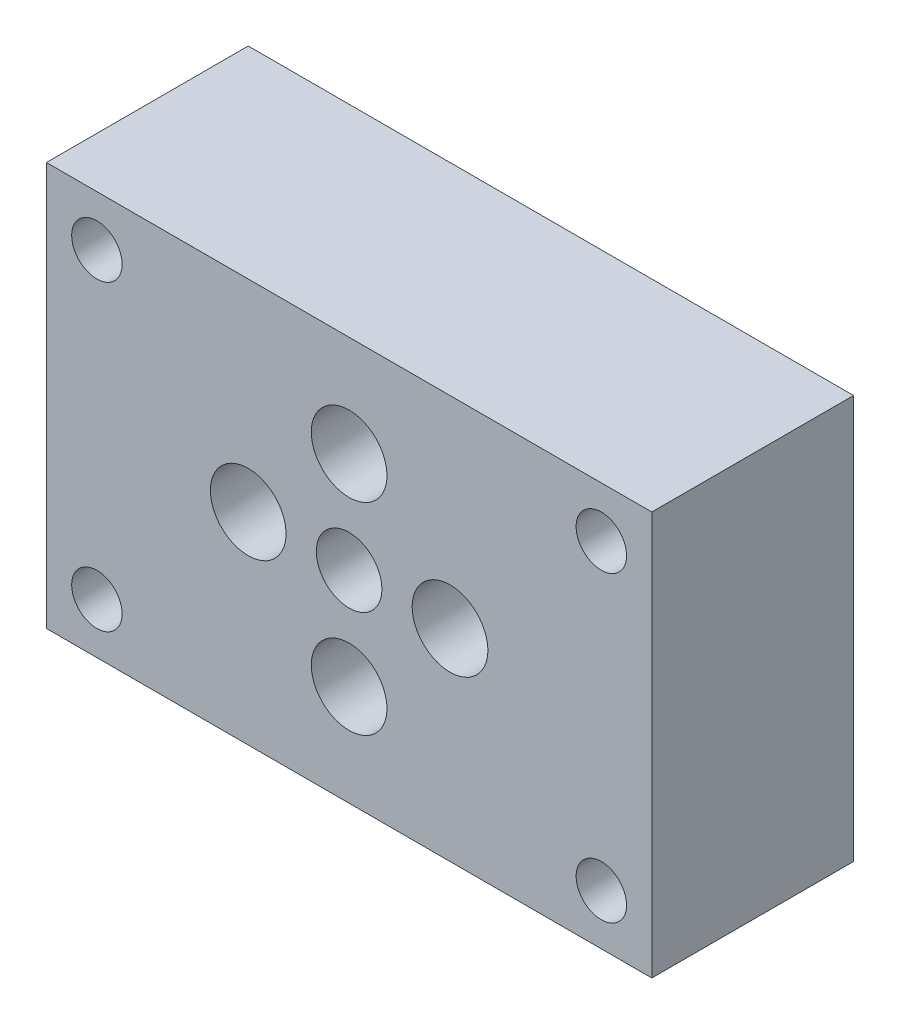
ISO-10303-21;
HEADER;
FILE_DESCRIPTION(('STEP AP214'),'2;1');
FILE_NAME('part.step','',(''),(''),'','','');
FILE_SCHEMA(('AUTOMOTIVE_DESIGN { 1 0 10303 214 1 1 1 1 }'));
ENDSEC;
DATA;
#1=APPLICATION_CONTEXT('core data for automotive mechanical design processes');
#2=APPLICATION_PROTOCOL_DEFINITION('international standard','automotive_design',2000,#1);
#3=PRODUCT_CONTEXT('',#1,'mechanical');
#4=PRODUCT('Part','Part','',(#3));
#5=PRODUCT_RELATED_PRODUCT_CATEGORY('part','',(#4));
#6=PRODUCT_DEFINITION_FORMATION('','',#4);
#7=PRODUCT_DEFINITION_CONTEXT('part definition',#1,'design');
#8=PRODUCT_DEFINITION('design','',#6,#7);
#9=PRODUCT_DEFINITION_SHAPE('','',#8);
#10=(LENGTH_UNIT() NAMED_UNIT(*) SI_UNIT(.MILLI.,.METRE.));
#11=(NAMED_UNIT(*) PLANE_ANGLE_UNIT() SI_UNIT($,.RADIAN.));
#12=(NAMED_UNIT(*) SI_UNIT($,.STERADIAN.) SOLID_ANGLE_UNIT());
#13=UNCERTAINTY_MEASURE_WITH_UNIT(LENGTH_MEASURE(1.E-05),#10,'distance_accuracy_value','');
#14=(GEOMETRIC_REPRESENTATION_CONTEXT(3) GLOBAL_UNCERTAINTY_ASSIGNED_CONTEXT((#13)) GLOBAL_UNIT_ASSIGNED_CONTEXT((#10,
#11,#12)) REPRESENTATION_CONTEXT('',''));
#15=CARTESIAN_POINT('',(0.,0.,0.));
#16=DIRECTION('',(0.,0.,1.));
#17=DIRECTION('',(1.,0.,0.));
#18=AXIS2_PLACEMENT_3D('',#15,#16,#17);
#19=CARTESIAN_POINT('',(-38.1,-25.4,-25.4));
#20=DIRECTION('',(-1.,0.,0.));
#21=DIRECTION('',(0.,0.,1.));
#22=AXIS2_PLACEMENT_3D('',#19,#20,#21);
#23=PLANE('',#22);
#24=DIRECTION('',(0.,-1.,0.));
#25=VECTOR('',#24,1.);
#26=CARTESIAN_POINT('',(-38.1,-25.4,0.));
#27=LINE('',#26,#25);
#28=CARTESIAN_POINT('',(-38.1,25.4,0.));
#29=VERTEX_POINT('',#28);
#30=CARTESIAN_POINT('',(-38.1,-25.4,0.));
#31=VERTEX_POINT('',#30);
#32=EDGE_CURVE('E102',#29,#31,#27,.T.);
#33=ORIENTED_EDGE('',*,*,#32,.F.);
#34=DIRECTION('',(0.,0.,1.));
#35=VECTOR('',#34,1.);
#36=CARTESIAN_POINT('',(-38.1,25.4,-25.4));
#37=LINE('',#36,#35);
#38=CARTESIAN_POINT('',(-38.1,25.4,-25.4));
#39=VERTEX_POINT('',#38);
#40=EDGE_CURVE('E11',#39,#29,#37,.T.);
#41=ORIENTED_EDGE('',*,*,#40,.F.);
#42=DIRECTION('',(0.,-1.,0.));
#43=VECTOR('',#42,1.);
#44=CARTESIAN_POINT('',(-38.1,-25.4,-25.4));
#45=LINE('',#44,#43);
#46=CARTESIAN_POINT('',(-38.1,-25.4,-25.4));
#47=VERTEX_POINT('',#46);
#48=EDGE_CURVE('E95',#39,#47,#45,.T.);
#49=ORIENTED_EDGE('',*,*,#48,.T.);
#50=DIRECTION('',(0.,0.,1.));
#51=VECTOR('',#50,1.);
#52=CARTESIAN_POINT('',(-38.1,-25.4,-25.4));
#53=LINE('',#52,#51);
#54=EDGE_CURVE('E40',#47,#31,#53,.T.);
#55=ORIENTED_EDGE('',*,*,#54,.T.);
#56=EDGE_LOOP('',(#33,#41,#49,#55));
#57=FACE_BOUND('',#56,.T.);
#58=ADVANCED_FACE('F37',(#57),#23,.T.);
#59=CARTESIAN_POINT('',(38.1,25.4,-25.4));
#60=DIRECTION('',(0.,1.,0.));
#61=DIRECTION('',(-1.,0.,0.));
#62=AXIS2_PLACEMENT_3D('',#59,#60,#61);
#63=PLANE('',#62);
#64=DIRECTION('',(-1.,0.,0.));
#65=VECTOR('',#64,1.);
#66=CARTESIAN_POINT('',(38.1,25.4,0.));
#67=LINE('',#66,#65);
#68=CARTESIAN_POINT('',(38.1,25.4,0.));
#69=VERTEX_POINT('',#68);
#70=EDGE_CURVE('E97',#69,#29,#67,.T.);
#71=ORIENTED_EDGE('',*,*,#70,.F.);
#72=DIRECTION('',(0.,0.,1.));
#73=VECTOR('',#72,1.);
#74=CARTESIAN_POINT('',(38.1,25.4,-25.4));
#75=LINE('',#74,#73);
#76=CARTESIAN_POINT('',(38.1,25.4,-25.4));
#77=VERTEX_POINT('',#76);
#78=EDGE_CURVE('E46',#77,#69,#75,.T.);
#79=ORIENTED_EDGE('',*,*,#78,.F.);
#80=DIRECTION('',(-1.,0.,0.));
#81=VECTOR('',#80,1.);
#82=CARTESIAN_POINT('',(38.1,25.4,-25.4));
#83=LINE('',#82,#81);
#84=EDGE_CURVE('E92',#77,#39,#83,.T.);
#85=ORIENTED_EDGE('',*,*,#84,.T.);
#86=ORIENTED_EDGE('',*,*,#40,.T.);
#87=EDGE_LOOP('',(#71,#79,#85,#86));
#88=FACE_BOUND('',#87,.T.);
#89=ADVANCED_FACE('F113',(#88),#63,.T.);
#90=CARTESIAN_POINT('',(38.1,-25.4,-25.4));
#91=DIRECTION('',(1.,0.,0.));
#92=DIRECTION('',(0.,0.,-1.));
#93=AXIS2_PLACEMENT_3D('',#90,#91,#92);
#94=PLANE('',#93);
#95=DIRECTION('',(0.,1.,0.));
#96=VECTOR('',#95,1.);
#97=CARTESIAN_POINT('',(38.1,-25.4,0.));
#98=LINE('',#97,#96);
#99=CARTESIAN_POINT('',(38.1,-25.4,0.));
#100=VERTEX_POINT('',#99);
#101=EDGE_CURVE('E87',#100,#69,#98,.T.);
#102=ORIENTED_EDGE('',*,*,#101,.F.);
#103=DIRECTION('',(0.,0.,1.));
#104=VECTOR('',#103,1.);
#105=CARTESIAN_POINT('',(38.1,-25.4,-25.4));
#106=LINE('',#105,#104);
#107=CARTESIAN_POINT('',(38.1,-25.4,-25.4));
#108=VERTEX_POINT('',#107);
#109=EDGE_CURVE('E82',#108,#100,#106,.T.);
#110=ORIENTED_EDGE('',*,*,#109,.F.);
#111=DIRECTION('',(0.,1.,0.));
#112=VECTOR('',#111,1.);
#113=CARTESIAN_POINT('',(38.1,-25.4,-25.4));
#114=LINE('',#113,#112);
#115=EDGE_CURVE('E85',#108,#77,#114,.T.);
#116=ORIENTED_EDGE('',*,*,#115,.T.);
#117=ORIENTED_EDGE('',*,*,#78,.T.);
#118=EDGE_LOOP('',(#102,#110,#116,#117));
#119=FACE_BOUND('',#118,.T.);
#120=ADVANCED_FACE('F84',(#119),#94,.T.);
#121=CARTESIAN_POINT('',(38.1,-25.4,-25.4));
#122=DIRECTION('',(0.,-1.,0.));
#123=DIRECTION('',(1.,0.,0.));
#124=AXIS2_PLACEMENT_3D('',#121,#122,#123);
#125=PLANE('',#124);
#126=DIRECTION('',(1.,0.,0.));
#127=VECTOR('',#126,1.);
#128=CARTESIAN_POINT('',(38.1,-25.4,0.));
#129=LINE('',#128,#127);
#130=EDGE_CURVE('E105',#31,#100,#129,.T.);
#131=ORIENTED_EDGE('',*,*,#130,.F.);
#132=ORIENTED_EDGE('',*,*,#54,.F.);
#133=DIRECTION('',(1.,0.,0.));
#134=VECTOR('',#133,1.);
#135=CARTESIAN_POINT('',(38.1,-25.4,-25.4));
#136=LINE('',#135,#134);
#137=EDGE_CURVE('E91',#47,#108,#136,.T.);
#138=ORIENTED_EDGE('',*,*,#137,.T.);
#139=ORIENTED_EDGE('',*,*,#109,.T.);
#140=EDGE_LOOP('',(#131,#132,#138,#139));
#141=FACE_BOUND('',#140,.T.);
#142=ADVANCED_FACE('F94',(#141),#125,.T.);
#143=CARTESIAN_POINT('',(0.,0.,-25.4));
#144=DIRECTION('',(0.,0.,1.));
#145=DIRECTION('',(1.,0.,0.));
#146=AXIS2_PLACEMENT_3D('',#143,#144,#145);
#147=PLANE('',#146);
#148=CARTESIAN_POINT('',(12.7,0.,-25.4));
#149=DIRECTION('',(0.,0.,-1.));
#150=DIRECTION('',(-1.,0.,0.));
#151=AXIS2_PLACEMENT_3D('',#148,#149,#150);
#152=CIRCLE('',#151,4.7625);
#153=CARTESIAN_POINT('',(7.9375,0.,-25.4));
#154=VERTEX_POINT('',#153);
#155=EDGE_CURVE('E177',#154,#154,#152,.T.);
#156=ORIENTED_EDGE('',*,*,#155,.F.);
#157=EDGE_LOOP('',(#156));
#158=FACE_BOUND('',#157,.T.);
#159=CARTESIAN_POINT('',(-12.7,0.,-25.4));
#160=DIRECTION('',(0.,0.,-1.));
#161=DIRECTION('',(-1.,0.,0.));
#162=AXIS2_PLACEMENT_3D('',#159,#160,#161);
#163=CIRCLE('',#162,4.7625);
#164=CARTESIAN_POINT('',(-17.4625,0.,-25.4));
#165=VERTEX_POINT('',#164);
#166=EDGE_CURVE('E183',#165,#165,#163,.T.);
#167=ORIENTED_EDGE('',*,*,#166,.F.);
#168=EDGE_LOOP('',(#167));
#169=FACE_BOUND('',#168,.T.);
#170=CARTESIAN_POINT('',(0.,12.7,-25.4));
#171=DIRECTION('',(0.,0.,-1.));
#172=DIRECTION('',(-1.,0.,0.));
#173=AXIS2_PLACEMENT_3D('',#170,#171,#172);
#174=CIRCLE('',#173,4.7625);
#175=CARTESIAN_POINT('',(-4.7625,12.7,-25.4));
#176=VERTEX_POINT('',#175);
#177=EDGE_CURVE('E192',#176,#176,#174,.T.);
#178=ORIENTED_EDGE('',*,*,#177,.F.);
#179=EDGE_LOOP('',(#178));
#180=FACE_BOUND('',#179,.T.);
#181=CARTESIAN_POINT('',(0.,-12.7,-25.4));
#182=DIRECTION('',(0.,0.,-1.));
#183=DIRECTION('',(-1.,0.,0.));
#184=AXIS2_PLACEMENT_3D('',#181,#182,#183);
#185=CIRCLE('',#184,4.7625);
#186=CARTESIAN_POINT('',(-4.7625,-12.7,-25.4));
#187=VERTEX_POINT('',#186);
#188=EDGE_CURVE('E180',#187,#187,#185,.T.);
#189=ORIENTED_EDGE('',*,*,#188,.F.);
#190=EDGE_LOOP('',(#189));
#191=FACE_BOUND('',#190,.T.);
#192=CARTESIAN_POINT('',(31.75,-19.05,-25.4));
#193=DIRECTION('',(0.,0.,-1.));
#194=DIRECTION('',(-1.,0.,0.));
#195=AXIS2_PLACEMENT_3D('',#192,#193,#194);
#196=CIRCLE('',#195,3.175);
#197=CARTESIAN_POINT('',(28.575,-19.05,-25.4));
#198=VERTEX_POINT('',#197);
#199=EDGE_CURVE('E204',#198,#198,#196,.T.);
#200=ORIENTED_EDGE('',*,*,#199,.F.);
#201=EDGE_LOOP('',(#200));
#202=FACE_BOUND('',#201,.T.);
#203=CARTESIAN_POINT('',(-31.75,-19.05,-25.4));
#204=DIRECTION('',(0.,0.,-1.));
#205=DIRECTION('',(-1.,0.,0.));
#206=AXIS2_PLACEMENT_3D('',#203,#204,#205);
#207=CIRCLE('',#206,3.175);
#208=CARTESIAN_POINT('',(-34.925,-19.05,-25.4));
#209=VERTEX_POINT('',#208);
#210=EDGE_CURVE('E191',#209,#209,#207,.T.);
#211=ORIENTED_EDGE('',*,*,#210,.F.);
#212=EDGE_LOOP('',(#211));
#213=FACE_BOUND('',#212,.T.);
#214=CARTESIAN_POINT('',(31.75,19.05,-25.4));
#215=DIRECTION('',(0.,0.,-1.));
#216=DIRECTION('',(-1.,0.,0.));
#217=AXIS2_PLACEMENT_3D('',#214,#215,#216);
#218=CIRCLE('',#217,3.175);
#219=CARTESIAN_POINT('',(28.575,19.05,-25.4));
#220=VERTEX_POINT('',#219);
#221=EDGE_CURVE('E216',#220,#220,#218,.T.);
#222=ORIENTED_EDGE('',*,*,#221,.F.);
#223=EDGE_LOOP('',(#222));
#224=FACE_BOUND('',#223,.T.);
#225=CARTESIAN_POINT('',(-31.75,19.05,-25.4));
#226=DIRECTION('',(0.,0.,-1.));
#227=DIRECTION('',(-1.,0.,0.));
#228=AXIS2_PLACEMENT_3D('',#225,#226,#227);
#229=CIRCLE('',#228,3.175);
#230=CARTESIAN_POINT('',(-34.925,19.05,-25.4));
#231=VERTEX_POINT('',#230);
#232=EDGE_CURVE('E203',#231,#231,#229,.T.);
#233=ORIENTED_EDGE('',*,*,#232,.F.);
#234=EDGE_LOOP('',(#233));
#235=FACE_BOUND('',#234,.T.);
#236=CARTESIAN_POINT('',(0.,0.,-25.4));
#237=DIRECTION('',(0.,0.,1.));
#238=DIRECTION('',(1.,0.,0.));
#239=AXIS2_PLACEMENT_3D('',#236,#237,#238);
#240=CIRCLE('',#239,4.1275);
#241=CARTESIAN_POINT('',(4.1275,0.,-25.4));
#242=VERTEX_POINT('',#241);
#243=EDGE_CURVE('E106',#242,#242,#240,.T.);
#244=ORIENTED_EDGE('',*,*,#243,.T.);
#245=EDGE_LOOP('',(#244));
#246=FACE_BOUND('',#245,.T.);
#247=ORIENTED_EDGE('',*,*,#48,.F.);
#248=ORIENTED_EDGE('',*,*,#84,.F.);
#249=ORIENTED_EDGE('',*,*,#115,.F.);
#250=ORIENTED_EDGE('',*,*,#137,.F.);
#251=EDGE_LOOP('',(#247,#248,#249,#250));
#252=FACE_BOUND('',#251,.T.);
#253=ADVANCED_FACE('F90',(#158,#169,#180,#191,#202,#213,#224,#235,#246,#252),#147,.F.);
#254=CARTESIAN_POINT('',(0.,0.,0.));
#255=DIRECTION('',(0.,0.,1.));
#256=DIRECTION('',(1.,0.,0.));
#257=AXIS2_PLACEMENT_3D('',#254,#255,#256);
#258=PLANE('',#257);
#259=CARTESIAN_POINT('',(12.7,0.,0.));
#260=DIRECTION('',(0.,0.,-1.));
#261=DIRECTION('',(-1.,0.,0.));
#262=AXIS2_PLACEMENT_3D('',#259,#260,#261);
#263=CIRCLE('',#262,4.7625);
#264=CARTESIAN_POINT('',(7.9375,0.,0.));
#265=VERTEX_POINT('',#264);
#266=EDGE_CURVE('E175',#265,#265,#263,.T.);
#267=ORIENTED_EDGE('',*,*,#266,.T.);
#268=EDGE_LOOP('',(#267));
#269=FACE_BOUND('',#268,.T.);
#270=CARTESIAN_POINT('',(-12.7,0.,0.));
#271=DIRECTION('',(0.,0.,-1.));
#272=DIRECTION('',(-1.,0.,0.));
#273=AXIS2_PLACEMENT_3D('',#270,#271,#272);
#274=CIRCLE('',#273,4.7625);
#275=CARTESIAN_POINT('',(-17.4625,0.,0.));
#276=VERTEX_POINT('',#275);
#277=EDGE_CURVE('E178',#276,#276,#274,.T.);
#278=ORIENTED_EDGE('',*,*,#277,.T.);
#279=EDGE_LOOP('',(#278));
#280=FACE_BOUND('',#279,.T.);
#281=CARTESIAN_POINT('',(0.,12.7,0.));
#282=DIRECTION('',(0.,0.,-1.));
#283=DIRECTION('',(-1.,0.,0.));
#284=AXIS2_PLACEMENT_3D('',#281,#282,#283);
#285=CIRCLE('',#284,4.7625);
#286=CARTESIAN_POINT('',(-4.7625,12.7,0.));
#287=VERTEX_POINT('',#286);
#288=EDGE_CURVE('E188',#287,#287,#285,.T.);
#289=ORIENTED_EDGE('',*,*,#288,.T.);
#290=EDGE_LOOP('',(#289));
#291=FACE_BOUND('',#290,.T.);
#292=CARTESIAN_POINT('',(0.,-12.7,0.));
#293=DIRECTION('',(0.,0.,-1.));
#294=DIRECTION('',(-1.,0.,0.));
#295=AXIS2_PLACEMENT_3D('',#292,#293,#294);
#296=CIRCLE('',#295,4.7625);
#297=CARTESIAN_POINT('',(-4.7625,-12.7,0.));
#298=VERTEX_POINT('',#297);
#299=EDGE_CURVE('E195',#298,#298,#296,.T.);
#300=ORIENTED_EDGE('',*,*,#299,.T.);
#301=EDGE_LOOP('',(#300));
#302=FACE_BOUND('',#301,.T.);
#303=CARTESIAN_POINT('',(31.75,-19.05,0.));
#304=DIRECTION('',(0.,0.,-1.));
#305=DIRECTION('',(-1.,0.,0.));
#306=AXIS2_PLACEMENT_3D('',#303,#304,#305);
#307=CIRCLE('',#306,3.175);
#308=CARTESIAN_POINT('',(28.575,-19.05,0.));
#309=VERTEX_POINT('',#308);
#310=EDGE_CURVE('E200',#309,#309,#307,.T.);
#311=ORIENTED_EDGE('',*,*,#310,.T.);
#312=EDGE_LOOP('',(#311));
#313=FACE_BOUND('',#312,.T.);
#314=CARTESIAN_POINT('',(-31.75,-19.05,0.));
#315=DIRECTION('',(0.,0.,-1.));
#316=DIRECTION('',(-1.,0.,0.));
#317=AXIS2_PLACEMENT_3D('',#314,#315,#316);
#318=CIRCLE('',#317,3.175);
#319=CARTESIAN_POINT('',(-34.925,-19.05,0.));
#320=VERTEX_POINT('',#319);
#321=EDGE_CURVE('E207',#320,#320,#318,.T.);
#322=ORIENTED_EDGE('',*,*,#321,.T.);
#323=EDGE_LOOP('',(#322));
#324=FACE_BOUND('',#323,.T.);
#325=CARTESIAN_POINT('',(31.75,19.05,0.));
#326=DIRECTION('',(0.,0.,-1.));
#327=DIRECTION('',(-1.,0.,0.));
#328=AXIS2_PLACEMENT_3D('',#325,#326,#327);
#329=CIRCLE('',#328,3.175);
#330=CARTESIAN_POINT('',(28.575,19.05,0.));
#331=VERTEX_POINT('',#330);
#332=EDGE_CURVE('E212',#331,#331,#329,.T.);
#333=ORIENTED_EDGE('',*,*,#332,.T.);
#334=EDGE_LOOP('',(#333));
#335=FACE_BOUND('',#334,.T.);
#336=CARTESIAN_POINT('',(-31.75,19.05,0.));
#337=DIRECTION('',(0.,0.,-1.));
#338=DIRECTION('',(-1.,0.,0.));
#339=AXIS2_PLACEMENT_3D('',#336,#337,#338);
#340=CIRCLE('',#339,3.175);
#341=CARTESIAN_POINT('',(-34.925,19.05,0.));
#342=VERTEX_POINT('',#341);
#343=EDGE_CURVE('E219',#342,#342,#340,.T.);
#344=ORIENTED_EDGE('',*,*,#343,.T.);
#345=EDGE_LOOP('',(#344));
#346=FACE_BOUND('',#345,.T.);
#347=CARTESIAN_POINT('',(0.,0.,0.));
#348=DIRECTION('',(0.,0.,1.));
#349=DIRECTION('',(1.,0.,0.));
#350=AXIS2_PLACEMENT_3D('',#347,#348,#349);
#351=CIRCLE('',#350,4.1275);
#352=CARTESIAN_POINT('',(4.1275,0.,0.));
#353=VERTEX_POINT('',#352);
#354=EDGE_CURVE('E215',#353,#353,#351,.T.);
#355=ORIENTED_EDGE('',*,*,#354,.F.);
#356=EDGE_LOOP('',(#355));
#357=FACE_BOUND('',#356,.T.);
#358=ORIENTED_EDGE('',*,*,#32,.T.);
#359=ORIENTED_EDGE('',*,*,#130,.T.);
#360=ORIENTED_EDGE('',*,*,#101,.T.);
#361=ORIENTED_EDGE('',*,*,#70,.T.);
#362=EDGE_LOOP('',(#358,#359,#360,#361));
#363=FACE_BOUND('',#362,.T.);
#364=ADVANCED_FACE('F112',(#269,#280,#291,#302,#313,#324,#335,#346,#357,#363),#258,.T.);
#365=CARTESIAN_POINT('',(0.,0.,-25.4));
#366=DIRECTION('',(0.,0.,1.));
#367=DIRECTION('',(1.,0.,0.));
#368=AXIS2_PLACEMENT_3D('',#365,#366,#367);
#369=CYLINDRICAL_SURFACE('',#368,4.1275);
#370=ORIENTED_EDGE('',*,*,#243,.F.);
#371=EDGE_LOOP('',(#370));
#372=FACE_BOUND('',#371,.T.);
#373=ORIENTED_EDGE('',*,*,#354,.T.);
#374=EDGE_LOOP('',(#373));
#375=FACE_BOUND('',#374,.T.);
#376=ADVANCED_FACE('F131',(#372,#375),#369,.F.);
#377=CARTESIAN_POINT('',(-31.75,19.05,0.));
#378=DIRECTION('',(0.,0.,-1.));
#379=DIRECTION('',(-1.,0.,0.));
#380=AXIS2_PLACEMENT_3D('',#377,#378,#379);
#381=CYLINDRICAL_SURFACE('',#380,3.175);
#382=ORIENTED_EDGE('',*,*,#343,.F.);
#383=EDGE_LOOP('',(#382));
#384=FACE_BOUND('',#383,.T.);
#385=ORIENTED_EDGE('',*,*,#232,.T.);
#386=EDGE_LOOP('',(#385));
#387=FACE_BOUND('',#386,.T.);
#388=ADVANCED_FACE('F138',(#384,#387),#381,.F.);
#389=CARTESIAN_POINT('',(31.75,19.05,0.));
#390=DIRECTION('',(0.,0.,-1.));
#391=DIRECTION('',(-1.,0.,0.));
#392=AXIS2_PLACEMENT_3D('',#389,#390,#391);
#393=CYLINDRICAL_SURFACE('',#392,3.175);
#394=ORIENTED_EDGE('',*,*,#332,.F.);
#395=EDGE_LOOP('',(#394));
#396=FACE_BOUND('',#395,.T.);
#397=ORIENTED_EDGE('',*,*,#221,.T.);
#398=EDGE_LOOP('',(#397));
#399=FACE_BOUND('',#398,.T.);
#400=ADVANCED_FACE('F142',(#396,#399),#393,.F.);
#401=CARTESIAN_POINT('',(-31.75,-19.05,0.));
#402=DIRECTION('',(0.,0.,-1.));
#403=DIRECTION('',(-1.,0.,0.));
#404=AXIS2_PLACEMENT_3D('',#401,#402,#403);
#405=CYLINDRICAL_SURFACE('',#404,3.175);
#406=ORIENTED_EDGE('',*,*,#321,.F.);
#407=EDGE_LOOP('',(#406));
#408=FACE_BOUND('',#407,.T.);
#409=ORIENTED_EDGE('',*,*,#210,.T.);
#410=EDGE_LOOP('',(#409));
#411=FACE_BOUND('',#410,.T.);
#412=ADVANCED_FACE('F146',(#408,#411),#405,.F.);
#413=CARTESIAN_POINT('',(31.75,-19.05,0.));
#414=DIRECTION('',(0.,0.,-1.));
#415=DIRECTION('',(-1.,0.,0.));
#416=AXIS2_PLACEMENT_3D('',#413,#414,#415);
#417=CYLINDRICAL_SURFACE('',#416,3.175);
#418=ORIENTED_EDGE('',*,*,#310,.F.);
#419=EDGE_LOOP('',(#418));
#420=FACE_BOUND('',#419,.T.);
#421=ORIENTED_EDGE('',*,*,#199,.T.);
#422=EDGE_LOOP('',(#421));
#423=FACE_BOUND('',#422,.T.);
#424=ADVANCED_FACE('F150',(#420,#423),#417,.F.);
#425=CARTESIAN_POINT('',(0.,-12.7,0.));
#426=DIRECTION('',(0.,0.,-1.));
#427=DIRECTION('',(-1.,0.,0.));
#428=AXIS2_PLACEMENT_3D('',#425,#426,#427);
#429=CYLINDRICAL_SURFACE('',#428,4.7625);
#430=ORIENTED_EDGE('',*,*,#299,.F.);
#431=EDGE_LOOP('',(#430));
#432=FACE_BOUND('',#431,.T.);
#433=ORIENTED_EDGE('',*,*,#188,.T.);
#434=EDGE_LOOP('',(#433));
#435=FACE_BOUND('',#434,.T.);
#436=ADVANCED_FACE('F154',(#432,#435),#429,.F.);
#437=CARTESIAN_POINT('',(0.,12.7,0.));
#438=DIRECTION('',(0.,0.,-1.));
#439=DIRECTION('',(-1.,0.,0.));
#440=AXIS2_PLACEMENT_3D('',#437,#438,#439);
#441=CYLINDRICAL_SURFACE('',#440,4.7625);
#442=ORIENTED_EDGE('',*,*,#288,.F.);
#443=EDGE_LOOP('',(#442));
#444=FACE_BOUND('',#443,.T.);
#445=ORIENTED_EDGE('',*,*,#177,.T.);
#446=EDGE_LOOP('',(#445));
#447=FACE_BOUND('',#446,.T.);
#448=ADVANCED_FACE('F158',(#444,#447),#441,.F.);
#449=CARTESIAN_POINT('',(-12.7,0.,0.));
#450=DIRECTION('',(0.,0.,-1.));
#451=DIRECTION('',(-1.,0.,0.));
#452=AXIS2_PLACEMENT_3D('',#449,#450,#451);
#453=CYLINDRICAL_SURFACE('',#452,4.7625);
#454=ORIENTED_EDGE('',*,*,#277,.F.);
#455=EDGE_LOOP('',(#454));
#456=FACE_BOUND('',#455,.T.);
#457=ORIENTED_EDGE('',*,*,#166,.T.);
#458=EDGE_LOOP('',(#457));
#459=FACE_BOUND('',#458,.T.);
#460=ADVANCED_FACE('F162',(#456,#459),#453,.F.);
#461=CARTESIAN_POINT('',(12.7,0.,0.));
#462=DIRECTION('',(0.,0.,-1.));
#463=DIRECTION('',(-1.,0.,0.));
#464=AXIS2_PLACEMENT_3D('',#461,#462,#463);
#465=CYLINDRICAL_SURFACE('',#464,4.7625);
#466=ORIENTED_EDGE('',*,*,#266,.F.);
#467=EDGE_LOOP('',(#466));
#468=FACE_BOUND('',#467,.T.);
#469=ORIENTED_EDGE('',*,*,#155,.T.);
#470=EDGE_LOOP('',(#469));
#471=FACE_BOUND('',#470,.T.);
#472=ADVANCED_FACE('F166',(#468,#471),#465,.F.);
#473=CLOSED_SHELL('',(#58,#89,#120,#142,#253,#364,#376,#388,#400,#412,#424,#436,#448,#460,#472));
#474=MANIFOLD_SOLID_BREP('B2',#473);
#475=ADVANCED_BREP_SHAPE_REPRESENTATION('',(#18,#474),#14);
#476=SHAPE_DEFINITION_REPRESENTATION(#9,#475);
ENDSEC;
END-ISO-10303-21;
